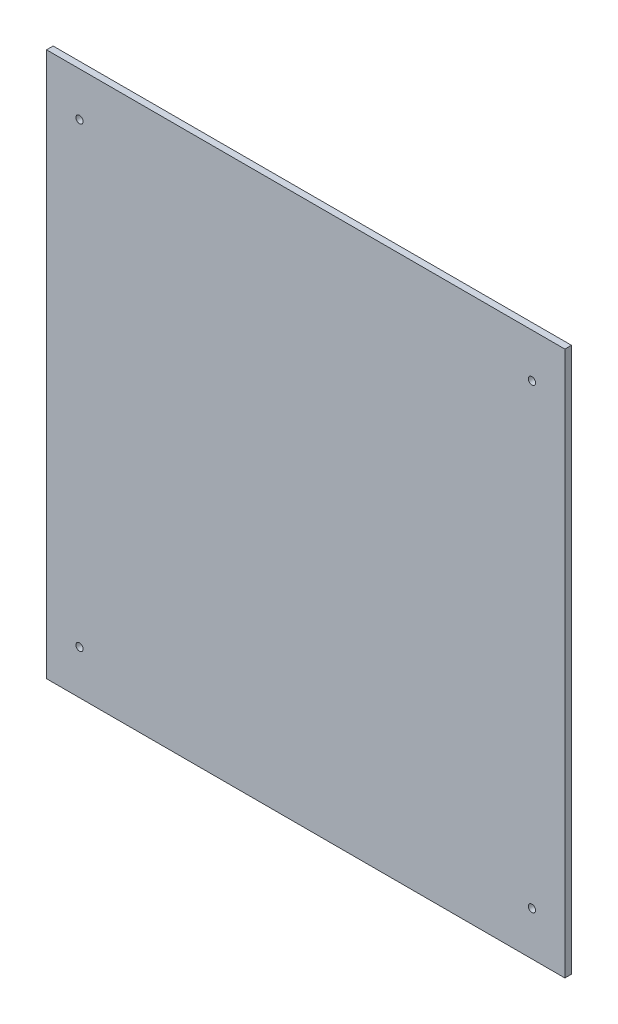
ISO-10303-21;
HEADER;
FILE_DESCRIPTION(('STEP AP214'),'2;1');
FILE_NAME('part.step','',(''),(''),'','','');
FILE_SCHEMA(('AUTOMOTIVE_DESIGN { 1 0 10303 214 1 1 1 1 }'));
ENDSEC;
DATA;
#1=APPLICATION_CONTEXT('core data for automotive mechanical design processes');
#2=APPLICATION_PROTOCOL_DEFINITION('international standard','automotive_design',2000,#1);
#3=PRODUCT_CONTEXT('',#1,'mechanical');
#4=PRODUCT('Part','Part','',(#3));
#5=PRODUCT_RELATED_PRODUCT_CATEGORY('part','',(#4));
#6=PRODUCT_DEFINITION_FORMATION('','',#4);
#7=PRODUCT_DEFINITION_CONTEXT('part definition',#1,'design');
#8=PRODUCT_DEFINITION('design','',#6,#7);
#9=PRODUCT_DEFINITION_SHAPE('','',#8);
#10=(LENGTH_UNIT() NAMED_UNIT(*) SI_UNIT(.MILLI.,.METRE.));
#11=(NAMED_UNIT(*) PLANE_ANGLE_UNIT() SI_UNIT($,.RADIAN.));
#12=(NAMED_UNIT(*) SI_UNIT($,.STERADIAN.) SOLID_ANGLE_UNIT());
#13=UNCERTAINTY_MEASURE_WITH_UNIT(LENGTH_MEASURE(1.E-05),#10,'distance_accuracy_value','');
#14=(GEOMETRIC_REPRESENTATION_CONTEXT(3) GLOBAL_UNCERTAINTY_ASSIGNED_CONTEXT((#13)) GLOBAL_UNIT_ASSIGNED_CONTEXT((#10,
#11,#12)) REPRESENTATION_CONTEXT('',''));
#15=CARTESIAN_POINT('',(0.,0.,0.));
#16=DIRECTION('',(0.,0.,1.));
#17=DIRECTION('',(1.,0.,0.));
#18=AXIS2_PLACEMENT_3D('',#15,#16,#17);
#19=CARTESIAN_POINT('',(0.,0.,3.));
#20=DIRECTION('',(1.,0.,0.));
#21=DIRECTION('',(0.,0.,-1.));
#22=AXIS2_PLACEMENT_3D('',#19,#20,#21);
#23=PLANE('',#22);
#24=DIRECTION('',(0.,-1.,0.));
#25=VECTOR('',#24,1.);
#26=CARTESIAN_POINT('',(0.,0.,0.));
#27=LINE('',#26,#25);
#28=CARTESIAN_POINT('',(0.,248.,0.));
#29=VERTEX_POINT('',#28);
#30=CARTESIAN_POINT('',(0.,0.,0.));
#31=VERTEX_POINT('',#30);
#32=EDGE_CURVE('E97',#29,#31,#27,.T.);
#33=ORIENTED_EDGE('',*,*,#32,.T.);
#34=DIRECTION('',(0.,0.,-1.));
#35=VECTOR('',#34,1.);
#36=CARTESIAN_POINT('',(0.,0.,3.));
#37=LINE('',#36,#35);
#38=CARTESIAN_POINT('',(0.,0.,3.));
#39=VERTEX_POINT('',#38);
#40=EDGE_CURVE('E11',#39,#31,#37,.T.);
#41=ORIENTED_EDGE('',*,*,#40,.F.);
#42=DIRECTION('',(0.,-1.,0.));
#43=VECTOR('',#42,1.);
#44=CARTESIAN_POINT('',(0.,0.,3.));
#45=LINE('',#44,#43);
#46=CARTESIAN_POINT('',(0.,248.,3.));
#47=VERTEX_POINT('',#46);
#48=EDGE_CURVE('E85',#47,#39,#45,.T.);
#49=ORIENTED_EDGE('',*,*,#48,.F.);
#50=DIRECTION('',(0.,0.,-1.));
#51=VECTOR('',#50,1.);
#52=CARTESIAN_POINT('',(0.,248.,3.));
#53=LINE('',#52,#51);
#54=EDGE_CURVE('E93',#47,#29,#53,.T.);
#55=ORIENTED_EDGE('',*,*,#54,.T.);
#56=EDGE_LOOP('',(#33,#41,#49,#55));
#57=FACE_BOUND('',#56,.T.);
#58=ADVANCED_FACE('F34',(#57),#23,.F.);
#59=CARTESIAN_POINT('',(0.,0.,3.));
#60=DIRECTION('',(0.,1.,0.));
#61=DIRECTION('',(0.,0.,1.));
#62=AXIS2_PLACEMENT_3D('',#59,#60,#61);
#63=PLANE('',#62);
#64=DIRECTION('',(1.,0.,0.));
#65=VECTOR('',#64,1.);
#66=CARTESIAN_POINT('',(0.,0.,0.));
#67=LINE('',#66,#65);
#68=CARTESIAN_POINT('',(236.,0.,0.));
#69=VERTEX_POINT('',#68);
#70=EDGE_CURVE('E89',#31,#69,#67,.T.);
#71=ORIENTED_EDGE('',*,*,#70,.T.);
#72=DIRECTION('',(0.,0.,-1.));
#73=VECTOR('',#72,1.);
#74=CARTESIAN_POINT('',(236.,0.,3.));
#75=LINE('',#74,#73);
#76=CARTESIAN_POINT('',(236.,0.,3.));
#77=VERTEX_POINT('',#76);
#78=EDGE_CURVE('E42',#77,#69,#75,.T.);
#79=ORIENTED_EDGE('',*,*,#78,.F.);
#80=DIRECTION('',(1.,0.,0.));
#81=VECTOR('',#80,1.);
#82=CARTESIAN_POINT('',(0.,0.,3.));
#83=LINE('',#82,#81);
#84=EDGE_CURVE('E80',#39,#77,#83,.T.);
#85=ORIENTED_EDGE('',*,*,#84,.F.);
#86=ORIENTED_EDGE('',*,*,#40,.T.);
#87=EDGE_LOOP('',(#71,#79,#85,#86));
#88=FACE_BOUND('',#87,.T.);
#89=ADVANCED_FACE('F88',(#88),#63,.F.);
#90=CARTESIAN_POINT('',(236.,0.,3.));
#91=DIRECTION('',(-1.,0.,0.));
#92=DIRECTION('',(0.,0.,1.));
#93=AXIS2_PLACEMENT_3D('',#90,#91,#92);
#94=PLANE('',#93);
#95=DIRECTION('',(0.,1.,0.));
#96=VECTOR('',#95,1.);
#97=CARTESIAN_POINT('',(236.,0.,0.));
#98=LINE('',#97,#96);
#99=CARTESIAN_POINT('',(236.,248.,0.));
#100=VERTEX_POINT('',#99);
#101=EDGE_CURVE('E67',#69,#100,#98,.T.);
#102=ORIENTED_EDGE('',*,*,#101,.T.);
#103=DIRECTION('',(0.,0.,-1.));
#104=VECTOR('',#103,1.);
#105=CARTESIAN_POINT('',(236.,248.,3.));
#106=LINE('',#105,#104);
#107=CARTESIAN_POINT('',(236.,248.,3.));
#108=VERTEX_POINT('',#107);
#109=EDGE_CURVE('E90',#108,#100,#106,.T.);
#110=ORIENTED_EDGE('',*,*,#109,.F.);
#111=DIRECTION('',(0.,1.,0.));
#112=VECTOR('',#111,1.);
#113=CARTESIAN_POINT('',(236.,0.,3.));
#114=LINE('',#113,#112);
#115=EDGE_CURVE('E83',#77,#108,#114,.T.);
#116=ORIENTED_EDGE('',*,*,#115,.F.);
#117=ORIENTED_EDGE('',*,*,#78,.T.);
#118=EDGE_LOOP('',(#102,#110,#116,#117));
#119=FACE_BOUND('',#118,.T.);
#120=ADVANCED_FACE('F91',(#119),#94,.F.);
#121=CARTESIAN_POINT('',(0.,248.,3.));
#122=DIRECTION('',(0.,-1.,0.));
#123=DIRECTION('',(0.,0.,-1.));
#124=AXIS2_PLACEMENT_3D('',#121,#122,#123);
#125=PLANE('',#124);
#126=DIRECTION('',(-1.,0.,0.));
#127=VECTOR('',#126,1.);
#128=CARTESIAN_POINT('',(0.,248.,0.));
#129=LINE('',#128,#127);
#130=EDGE_CURVE('E73',#100,#29,#129,.T.);
#131=ORIENTED_EDGE('',*,*,#130,.T.);
#132=ORIENTED_EDGE('',*,*,#54,.F.);
#133=DIRECTION('',(-1.,0.,0.));
#134=VECTOR('',#133,1.);
#135=CARTESIAN_POINT('',(0.,248.,3.));
#136=LINE('',#135,#134);
#137=EDGE_CURVE('E50',#108,#47,#136,.T.);
#138=ORIENTED_EDGE('',*,*,#137,.F.);
#139=ORIENTED_EDGE('',*,*,#109,.T.);
#140=EDGE_LOOP('',(#131,#132,#138,#139));
#141=FACE_BOUND('',#140,.T.);
#142=ADVANCED_FACE('F105',(#141),#125,.F.);
#143=CARTESIAN_POINT('',(0.,0.,3.));
#144=DIRECTION('',(0.,0.,-1.));
#145=DIRECTION('',(-1.,0.,0.));
#146=AXIS2_PLACEMENT_3D('',#143,#144,#145);
#147=PLANE('',#146);
#148=CARTESIAN_POINT('',(15.,20.,3.));
#149=DIRECTION('',(0.,0.,1.));
#150=DIRECTION('',(-1.,0.,0.));
#151=AXIS2_PLACEMENT_3D('',#148,#149,#150);
#152=CIRCLE('',#151,1.65000000000001);
#153=CARTESIAN_POINT('',(13.35,20.,3.));
#154=VERTEX_POINT('',#153);
#155=EDGE_CURVE('E117',#154,#154,#152,.T.);
#156=ORIENTED_EDGE('',*,*,#155,.F.);
#157=EDGE_LOOP('',(#156));
#158=FACE_BOUND('',#157,.T.);
#159=CARTESIAN_POINT('',(221.,20.,3.));
#160=DIRECTION('',(0.,0.,1.));
#161=DIRECTION('',(1.,0.,0.));
#162=AXIS2_PLACEMENT_3D('',#159,#160,#161);
#163=CIRCLE('',#162,1.64999999999999);
#164=CARTESIAN_POINT('',(222.65,20.,3.));
#165=VERTEX_POINT('',#164);
#166=EDGE_CURVE('E123',#165,#165,#163,.T.);
#167=ORIENTED_EDGE('',*,*,#166,.F.);
#168=EDGE_LOOP('',(#167));
#169=FACE_BOUND('',#168,.T.);
#170=CARTESIAN_POINT('',(221.,228.,3.));
#171=DIRECTION('',(0.,0.,1.));
#172=DIRECTION('',(-1.,0.,0.));
#173=AXIS2_PLACEMENT_3D('',#170,#171,#172);
#174=CIRCLE('',#173,1.64999999999998);
#175=CARTESIAN_POINT('',(219.35,228.,3.));
#176=VERTEX_POINT('',#175);
#177=EDGE_CURVE('E129',#176,#176,#174,.T.);
#178=ORIENTED_EDGE('',*,*,#177,.F.);
#179=EDGE_LOOP('',(#178));
#180=FACE_BOUND('',#179,.T.);
#181=CARTESIAN_POINT('',(15.,228.,3.));
#182=DIRECTION('',(0.,0.,1.));
#183=DIRECTION('',(1.,0.,0.));
#184=AXIS2_PLACEMENT_3D('',#181,#182,#183);
#185=CIRCLE('',#184,1.65000000000002);
#186=CARTESIAN_POINT('',(16.65,228.,3.));
#187=VERTEX_POINT('',#186);
#188=EDGE_CURVE('E111',#187,#187,#185,.T.);
#189=ORIENTED_EDGE('',*,*,#188,.F.);
#190=EDGE_LOOP('',(#189));
#191=FACE_BOUND('',#190,.T.);
#192=ORIENTED_EDGE('',*,*,#48,.T.);
#193=ORIENTED_EDGE('',*,*,#84,.T.);
#194=ORIENTED_EDGE('',*,*,#115,.T.);
#195=ORIENTED_EDGE('',*,*,#137,.T.);
#196=EDGE_LOOP('',(#192,#193,#194,#195));
#197=FACE_BOUND('',#196,.T.);
#198=ADVANCED_FACE('F81',(#158,#169,#180,#191,#197),#147,.F.);
#199=CARTESIAN_POINT('',(0.,0.,0.));
#200=DIRECTION('',(0.,0.,-1.));
#201=DIRECTION('',(-1.,0.,0.));
#202=AXIS2_PLACEMENT_3D('',#199,#200,#201);
#203=PLANE('',#202);
#204=CARTESIAN_POINT('',(15.,20.,0.));
#205=DIRECTION('',(0.,0.,1.));
#206=DIRECTION('',(-1.,0.,0.));
#207=AXIS2_PLACEMENT_3D('',#204,#205,#206);
#208=CIRCLE('',#207,1.65000000000001);
#209=CARTESIAN_POINT('',(13.35,20.,0.));
#210=VERTEX_POINT('',#209);
#211=EDGE_CURVE('E120',#210,#210,#208,.T.);
#212=ORIENTED_EDGE('',*,*,#211,.T.);
#213=EDGE_LOOP('',(#212));
#214=FACE_BOUND('',#213,.T.);
#215=CARTESIAN_POINT('',(221.,20.,0.));
#216=DIRECTION('',(0.,0.,1.));
#217=DIRECTION('',(1.,0.,0.));
#218=AXIS2_PLACEMENT_3D('',#215,#216,#217);
#219=CIRCLE('',#218,1.64999999999999);
#220=CARTESIAN_POINT('',(222.65,20.,0.));
#221=VERTEX_POINT('',#220);
#222=EDGE_CURVE('E126',#221,#221,#219,.T.);
#223=ORIENTED_EDGE('',*,*,#222,.T.);
#224=EDGE_LOOP('',(#223));
#225=FACE_BOUND('',#224,.T.);
#226=CARTESIAN_POINT('',(221.,228.,0.));
#227=DIRECTION('',(0.,0.,1.));
#228=DIRECTION('',(-1.,0.,0.));
#229=AXIS2_PLACEMENT_3D('',#226,#227,#228);
#230=CIRCLE('',#229,1.64999999999998);
#231=CARTESIAN_POINT('',(219.35,228.,0.));
#232=VERTEX_POINT('',#231);
#233=EDGE_CURVE('E114',#232,#232,#230,.T.);
#234=ORIENTED_EDGE('',*,*,#233,.T.);
#235=EDGE_LOOP('',(#234));
#236=FACE_BOUND('',#235,.T.);
#237=CARTESIAN_POINT('',(15.,228.,0.));
#238=DIRECTION('',(0.,0.,1.));
#239=DIRECTION('',(1.,0.,0.));
#240=AXIS2_PLACEMENT_3D('',#237,#238,#239);
#241=CIRCLE('',#240,1.65000000000002);
#242=CARTESIAN_POINT('',(16.65,228.,0.));
#243=VERTEX_POINT('',#242);
#244=EDGE_CURVE('E100',#243,#243,#241,.T.);
#245=ORIENTED_EDGE('',*,*,#244,.T.);
#246=EDGE_LOOP('',(#245));
#247=FACE_BOUND('',#246,.T.);
#248=ORIENTED_EDGE('',*,*,#32,.F.);
#249=ORIENTED_EDGE('',*,*,#130,.F.);
#250=ORIENTED_EDGE('',*,*,#101,.F.);
#251=ORIENTED_EDGE('',*,*,#70,.F.);
#252=EDGE_LOOP('',(#248,#249,#250,#251));
#253=FACE_BOUND('',#252,.T.);
#254=ADVANCED_FACE('F108',(#214,#225,#236,#247,#253),#203,.T.);
#255=CARTESIAN_POINT('',(15.,228.,0.));
#256=DIRECTION('',(0.,0.,1.));
#257=DIRECTION('',(1.,0.,0.));
#258=AXIS2_PLACEMENT_3D('',#255,#256,#257);
#259=CYLINDRICAL_SURFACE('',#258,1.65000000000002);
#260=ORIENTED_EDGE('',*,*,#244,.F.);
#261=EDGE_LOOP('',(#260));
#262=FACE_BOUND('',#261,.T.);
#263=ORIENTED_EDGE('',*,*,#188,.T.);
#264=EDGE_LOOP('',(#263));
#265=FACE_BOUND('',#264,.T.);
#266=ADVANCED_FACE('F141',(#262,#265),#259,.F.);
#267=CARTESIAN_POINT('',(221.,228.,0.));
#268=DIRECTION('',(0.,0.,1.));
#269=DIRECTION('',(1.,0.,0.));
#270=AXIS2_PLACEMENT_3D('',#267,#268,#269);
#271=CYLINDRICAL_SURFACE('',#270,1.64999999999998);
#272=ORIENTED_EDGE('',*,*,#233,.F.);
#273=EDGE_LOOP('',(#272));
#274=FACE_BOUND('',#273,.T.);
#275=ORIENTED_EDGE('',*,*,#177,.T.);
#276=EDGE_LOOP('',(#275));
#277=FACE_BOUND('',#276,.T.);
#278=ADVANCED_FACE('F137',(#274,#277),#271,.F.);
#279=CARTESIAN_POINT('',(221.,20.,0.));
#280=DIRECTION('',(0.,0.,1.));
#281=DIRECTION('',(1.,0.,0.));
#282=AXIS2_PLACEMENT_3D('',#279,#280,#281);
#283=CYLINDRICAL_SURFACE('',#282,1.64999999999999);
#284=ORIENTED_EDGE('',*,*,#222,.F.);
#285=EDGE_LOOP('',(#284));
#286=FACE_BOUND('',#285,.T.);
#287=ORIENTED_EDGE('',*,*,#166,.T.);
#288=EDGE_LOOP('',(#287));
#289=FACE_BOUND('',#288,.T.);
#290=ADVANCED_FACE('F140',(#286,#289),#283,.F.);
#291=CARTESIAN_POINT('',(15.,20.,0.));
#292=DIRECTION('',(0.,0.,1.));
#293=DIRECTION('',(1.,0.,0.));
#294=AXIS2_PLACEMENT_3D('',#291,#292,#293);
#295=CYLINDRICAL_SURFACE('',#294,1.65000000000001);
#296=ORIENTED_EDGE('',*,*,#211,.F.);
#297=EDGE_LOOP('',(#296));
#298=FACE_BOUND('',#297,.T.);
#299=ORIENTED_EDGE('',*,*,#155,.T.);
#300=EDGE_LOOP('',(#299));
#301=FACE_BOUND('',#300,.T.);
#302=ADVANCED_FACE('F202',(#298,#301),#295,.F.);
#303=CLOSED_SHELL('',(#58,#89,#120,#142,#198,#254,#266,#278,#290,#302));
#304=MANIFOLD_SOLID_BREP('B2',#303);
#305=ADVANCED_BREP_SHAPE_REPRESENTATION('',(#18,#304),#14);
#306=SHAPE_DEFINITION_REPRESENTATION(#9,#305);
ENDSEC;
END-ISO-10303-21;
